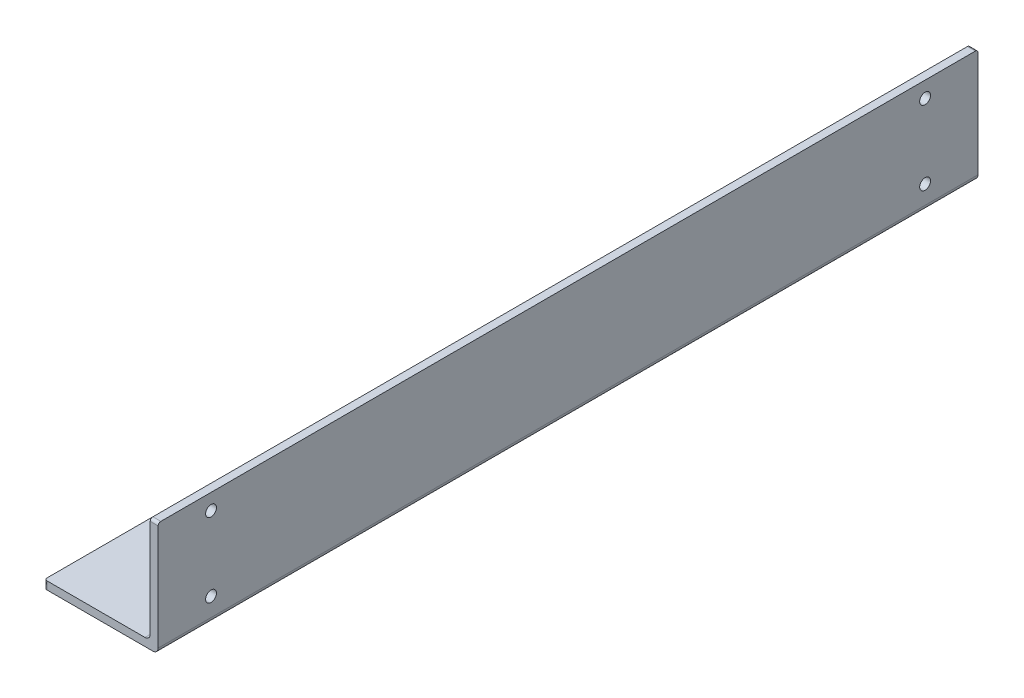
ISO-10303-21;
HEADER;
FILE_DESCRIPTION(('STEP AP214'),'2;1');
FILE_NAME('part.step','',(''),(''),'','','');
FILE_SCHEMA(('AUTOMOTIVE_DESIGN { 1 0 10303 214 1 1 1 1 }'));
ENDSEC;
DATA;
#1=APPLICATION_CONTEXT('core data for automotive mechanical design processes');
#2=APPLICATION_PROTOCOL_DEFINITION('international standard','automotive_design',2000,#1);
#3=PRODUCT_CONTEXT('',#1,'mechanical');
#4=PRODUCT('Part','Part','',(#3));
#5=PRODUCT_RELATED_PRODUCT_CATEGORY('part','',(#4));
#6=PRODUCT_DEFINITION_FORMATION('','',#4);
#7=PRODUCT_DEFINITION_CONTEXT('part definition',#1,'design');
#8=PRODUCT_DEFINITION('design','',#6,#7);
#9=PRODUCT_DEFINITION_SHAPE('','',#8);
#10=(LENGTH_UNIT() NAMED_UNIT(*) SI_UNIT(.MILLI.,.METRE.));
#11=(NAMED_UNIT(*) PLANE_ANGLE_UNIT() SI_UNIT($,.RADIAN.));
#12=(NAMED_UNIT(*) SI_UNIT($,.STERADIAN.) SOLID_ANGLE_UNIT());
#13=UNCERTAINTY_MEASURE_WITH_UNIT(LENGTH_MEASURE(1.E-05),#10,'distance_accuracy_value','');
#14=(GEOMETRIC_REPRESENTATION_CONTEXT(3) GLOBAL_UNCERTAINTY_ASSIGNED_CONTEXT((#13)) GLOBAL_UNIT_ASSIGNED_CONTEXT((#10,
#11,#12)) REPRESENTATION_CONTEXT('',''));
#15=CARTESIAN_POINT('',(0.,0.,0.));
#16=DIRECTION('',(0.,0.,1.));
#17=DIRECTION('',(1.,0.,0.));
#18=AXIS2_PLACEMENT_3D('',#15,#16,#17);
#19=CARTESIAN_POINT('',(3.,0.,0.));
#20=DIRECTION('',(0.,0.,-1.));
#21=DIRECTION('',(-1.,0.,0.));
#22=AXIS2_PLACEMENT_3D('',#19,#20,#21);
#23=PLANE('',#22);
#24=DIRECTION('',(1.,0.,0.));
#25=VECTOR('',#24,1.);
#26=CARTESIAN_POINT('',(0.,3.,0.));
#27=LINE('',#26,#25);
#28=CARTESIAN_POINT('',(-39.,3.,0.));
#29=VERTEX_POINT('',#28);
#30=CARTESIAN_POINT('',(-2.,3.,0.));
#31=VERTEX_POINT('',#30);
#32=EDGE_CURVE('E262',#29,#31,#27,.T.);
#33=ORIENTED_EDGE('',*,*,#32,.F.);
#34=DIRECTION('',(0.,-1.,0.));
#35=VECTOR('',#34,1.);
#36=CARTESIAN_POINT('',(-39.,0.,0.));
#37=LINE('',#36,#35);
#38=CARTESIAN_POINT('',(-39.,0.,0.));
#39=VERTEX_POINT('',#38);
#40=EDGE_CURVE('E190',#29,#39,#37,.T.);
#41=ORIENTED_EDGE('',*,*,#40,.T.);
#42=DIRECTION('',(-1.,0.,0.));
#43=VECTOR('',#42,1.);
#44=CARTESIAN_POINT('',(3.,0.,0.));
#45=LINE('',#44,#43);
#46=CARTESIAN_POINT('',(1.,0.,0.));
#47=VERTEX_POINT('',#46);
#48=EDGE_CURVE('E153',#47,#39,#45,.T.);
#49=ORIENTED_EDGE('',*,*,#48,.F.);
#50=CARTESIAN_POINT('',(1.,2.,0.));
#51=DIRECTION('',(0.,0.,-1.));
#52=DIRECTION('',(-1.,0.,0.));
#53=AXIS2_PLACEMENT_3D('',#50,#51,#52);
#54=CIRCLE('',#53,2.);
#55=CARTESIAN_POINT('',(3.,2.,0.));
#56=VERTEX_POINT('',#55);
#57=EDGE_CURVE('E149',#47,#56,#54,.F.);
#58=ORIENTED_EDGE('',*,*,#57,.T.);
#59=DIRECTION('',(0.,-1.,0.));
#60=VECTOR('',#59,1.);
#61=CARTESIAN_POINT('',(3.,0.,0.));
#62=LINE('',#61,#60);
#63=CARTESIAN_POINT('',(3.,42.,0.));
#64=VERTEX_POINT('',#63);
#65=EDGE_CURVE('E133',#64,#56,#62,.T.);
#66=ORIENTED_EDGE('',*,*,#65,.F.);
#67=DIRECTION('',(-1.,0.,0.));
#68=VECTOR('',#67,1.);
#69=CARTESIAN_POINT('',(3.,42.,0.));
#70=LINE('',#69,#68);
#71=CARTESIAN_POINT('',(0.,42.,0.));
#72=VERTEX_POINT('',#71);
#73=EDGE_CURVE('E187',#64,#72,#70,.T.);
#74=ORIENTED_EDGE('',*,*,#73,.T.);
#75=DIRECTION('',(0.,-1.,0.));
#76=VECTOR('',#75,1.);
#77=CARTESIAN_POINT('',(0.,0.,0.));
#78=LINE('',#77,#76);
#79=CARTESIAN_POINT('',(0.,5.,0.));
#80=VERTEX_POINT('',#79);
#81=EDGE_CURVE('E270',#72,#80,#78,.T.);
#82=ORIENTED_EDGE('',*,*,#81,.T.);
#83=CARTESIAN_POINT('',(-2.,5.,0.));
#84=DIRECTION('',(0.,0.,-1.));
#85=DIRECTION('',(-1.,0.,0.));
#86=AXIS2_PLACEMENT_3D('',#83,#84,#85);
#87=CIRCLE('',#86,2.);
#88=EDGE_CURVE('E183',#80,#31,#87,.T.);
#89=ORIENTED_EDGE('',*,*,#88,.T.);
#90=EDGE_LOOP('',(#33,#41,#49,#58,#66,#74,#82,#89));
#91=FACE_BOUND('',#90,.T.);
#92=ADVANCED_FACE('F42',(#91),#23,.F.);
#93=CARTESIAN_POINT('',(3.,0.,0.));
#94=DIRECTION('',(0.,1.,0.));
#95=DIRECTION('',(0.,0.,1.));
#96=AXIS2_PLACEMENT_3D('',#93,#94,#95);
#97=PLANE('',#96);
#98=ORIENTED_EDGE('',*,*,#48,.T.);
#99=CARTESIAN_POINT('',(-39.,0.,-1.));
#100=DIRECTION('',(0.,1.,0.));
#101=DIRECTION('',(0.,0.,1.));
#102=AXIS2_PLACEMENT_3D('',#99,#100,#101);
#103=CIRCLE('',#102,1.);
#104=CARTESIAN_POINT('',(-40.,0.,-1.));
#105=VERTEX_POINT('',#104);
#106=EDGE_CURVE('E196',#39,#105,#103,.F.);
#107=ORIENTED_EDGE('',*,*,#106,.T.);
#108=DIRECTION('',(0.,0.,1.));
#109=VECTOR('',#108,1.);
#110=CARTESIAN_POINT('',(-40.,0.,-310.));
#111=LINE('',#110,#109);
#112=CARTESIAN_POINT('',(-40.,0.,-309.));
#113=VERTEX_POINT('',#112);
#114=EDGE_CURVE('E247',#113,#105,#111,.T.);
#115=ORIENTED_EDGE('',*,*,#114,.F.);
#116=CARTESIAN_POINT('',(-39.,0.,-309.));
#117=DIRECTION('',(0.,1.,0.));
#118=DIRECTION('',(0.,0.,1.));
#119=AXIS2_PLACEMENT_3D('',#116,#117,#118);
#120=CIRCLE('',#119,1.);
#121=CARTESIAN_POINT('',(-39.,0.,-310.));
#122=VERTEX_POINT('',#121);
#123=EDGE_CURVE('E193',#113,#122,#120,.F.);
#124=ORIENTED_EDGE('',*,*,#123,.T.);
#125=DIRECTION('',(-1.,0.,0.));
#126=VECTOR('',#125,1.);
#127=CARTESIAN_POINT('',(3.,0.,-310.));
#128=LINE('',#127,#126);
#129=CARTESIAN_POINT('',(1.,0.,-310.));
#130=VERTEX_POINT('',#129);
#131=EDGE_CURVE('E167',#130,#122,#128,.T.);
#132=ORIENTED_EDGE('',*,*,#131,.F.);
#133=DIRECTION('',(0.,0.,-1.));
#134=VECTOR('',#133,1.);
#135=CARTESIAN_POINT('',(1.,0.,0.));
#136=LINE('',#135,#134);
#137=EDGE_CURVE('E158',#130,#47,#136,.F.);
#138=ORIENTED_EDGE('',*,*,#137,.T.);
#139=EDGE_LOOP('',(#98,#107,#115,#124,#132,#138));
#140=FACE_BOUND('',#139,.T.);
#141=ADVANCED_FACE('F341',(#140),#97,.F.);
#142=CARTESIAN_POINT('',(3.,43.,-310.));
#143=DIRECTION('',(0.,0.,1.));
#144=DIRECTION('',(1.,0.,0.));
#145=AXIS2_PLACEMENT_3D('',#142,#143,#144);
#146=PLANE('',#145);
#147=ORIENTED_EDGE('',*,*,#131,.T.);
#148=DIRECTION('',(0.,-1.,0.));
#149=VECTOR('',#148,1.);
#150=CARTESIAN_POINT('',(-39.,43.,-310.));
#151=LINE('',#150,#149);
#152=CARTESIAN_POINT('',(-39.,3.,-310.));
#153=VERTEX_POINT('',#152);
#154=EDGE_CURVE('E215',#122,#153,#151,.F.);
#155=ORIENTED_EDGE('',*,*,#154,.T.);
#156=DIRECTION('',(-1.,0.,0.));
#157=VECTOR('',#156,1.);
#158=CARTESIAN_POINT('',(0.,3.,-310.));
#159=LINE('',#158,#157);
#160=CARTESIAN_POINT('',(-2.,3.,-310.));
#161=VERTEX_POINT('',#160);
#162=EDGE_CURVE('E252',#161,#153,#159,.T.);
#163=ORIENTED_EDGE('',*,*,#162,.F.);
#164=CARTESIAN_POINT('',(-2.,5.,-310.));
#165=DIRECTION('',(0.,0.,1.));
#166=DIRECTION('',(1.,0.,0.));
#167=AXIS2_PLACEMENT_3D('',#164,#165,#166);
#168=CIRCLE('',#167,2.);
#169=CARTESIAN_POINT('',(0.,5.,-310.));
#170=VERTEX_POINT('',#169);
#171=EDGE_CURVE('E180',#161,#170,#168,.T.);
#172=ORIENTED_EDGE('',*,*,#171,.T.);
#173=DIRECTION('',(0.,1.,0.));
#174=VECTOR('',#173,1.);
#175=CARTESIAN_POINT('',(0.,43.,-310.));
#176=LINE('',#175,#174);
#177=CARTESIAN_POINT('',(0.,42.,-310.));
#178=VERTEX_POINT('',#177);
#179=EDGE_CURVE('E273',#170,#178,#176,.T.);
#180=ORIENTED_EDGE('',*,*,#179,.T.);
#181=DIRECTION('',(-1.,0.,0.));
#182=VECTOR('',#181,1.);
#183=CARTESIAN_POINT('',(3.,42.,-310.));
#184=LINE('',#183,#182);
#185=CARTESIAN_POINT('',(3.,42.,-310.));
#186=VERTEX_POINT('',#185);
#187=EDGE_CURVE('E212',#178,#186,#184,.F.);
#188=ORIENTED_EDGE('',*,*,#187,.T.);
#189=DIRECTION('',(0.,1.,0.));
#190=VECTOR('',#189,1.);
#191=CARTESIAN_POINT('',(3.,43.,-310.));
#192=LINE('',#191,#190);
#193=CARTESIAN_POINT('',(3.,2.,-310.));
#194=VERTEX_POINT('',#193);
#195=EDGE_CURVE('E144',#194,#186,#192,.T.);
#196=ORIENTED_EDGE('',*,*,#195,.F.);
#197=CARTESIAN_POINT('',(1.,2.,-310.));
#198=DIRECTION('',(0.,0.,1.));
#199=DIRECTION('',(1.,0.,0.));
#200=AXIS2_PLACEMENT_3D('',#197,#198,#199);
#201=CIRCLE('',#200,2.);
#202=EDGE_CURVE('E161',#194,#130,#201,.F.);
#203=ORIENTED_EDGE('',*,*,#202,.T.);
#204=EDGE_LOOP('',(#147,#155,#163,#172,#180,#188,#196,#203));
#205=FACE_BOUND('',#204,.T.);
#206=ADVANCED_FACE('F283',(#205),#146,.F.);
#207=CARTESIAN_POINT('',(3.,43.,0.));
#208=DIRECTION('',(0.,-1.,0.));
#209=DIRECTION('',(0.,0.,-1.));
#210=AXIS2_PLACEMENT_3D('',#207,#208,#209);
#211=PLANE('',#210);
#212=DIRECTION('',(0.,0.,1.));
#213=VECTOR('',#212,1.);
#214=CARTESIAN_POINT('',(3.,43.,0.));
#215=LINE('',#214,#213);
#216=CARTESIAN_POINT('',(3.,43.,-309.));
#217=VERTEX_POINT('',#216);
#218=CARTESIAN_POINT('',(3.,43.,-1.));
#219=VERTEX_POINT('',#218);
#220=EDGE_CURVE('E267',#217,#219,#215,.T.);
#221=ORIENTED_EDGE('',*,*,#220,.F.);
#222=DIRECTION('',(-1.,0.,0.));
#223=VECTOR('',#222,1.);
#224=CARTESIAN_POINT('',(3.,43.,-309.));
#225=LINE('',#224,#223);
#226=CARTESIAN_POINT('',(0.,43.,-309.));
#227=VERTEX_POINT('',#226);
#228=EDGE_CURVE('E220',#217,#227,#225,.T.);
#229=ORIENTED_EDGE('',*,*,#228,.T.);
#230=DIRECTION('',(0.,0.,1.));
#231=VECTOR('',#230,1.);
#232=CARTESIAN_POINT('',(0.,43.,0.));
#233=LINE('',#232,#231);
#234=CARTESIAN_POINT('',(0.,43.,-1.));
#235=VERTEX_POINT('',#234);
#236=EDGE_CURVE('E145',#227,#235,#233,.T.);
#237=ORIENTED_EDGE('',*,*,#236,.T.);
#238=DIRECTION('',(-1.,0.,0.));
#239=VECTOR('',#238,1.);
#240=CARTESIAN_POINT('',(3.,43.,-1.));
#241=LINE('',#240,#239);
#242=EDGE_CURVE('E60',#235,#219,#241,.F.);
#243=ORIENTED_EDGE('',*,*,#242,.T.);
#244=EDGE_LOOP('',(#221,#229,#237,#243));
#245=FACE_BOUND('',#244,.T.);
#246=ADVANCED_FACE('F320',(#245),#211,.F.);
#247=CARTESIAN_POINT('',(3.,0.,0.));
#248=DIRECTION('',(-1.,0.,0.));
#249=DIRECTION('',(0.,0.,1.));
#250=AXIS2_PLACEMENT_3D('',#247,#248,#249);
#251=PLANE('',#250);
#252=CARTESIAN_POINT('',(3.,37.,-290.));
#253=DIRECTION('',(1.,0.,0.));
#254=DIRECTION('',(0.,0.,1.));
#255=AXIS2_PLACEMENT_3D('',#252,#253,#254);
#256=CIRCLE('',#255,2.04999999999997);
#257=CARTESIAN_POINT('',(3.,37.,-287.95));
#258=VERTEX_POINT('',#257);
#259=EDGE_CURVE('E303',#258,#258,#256,.T.);
#260=ORIENTED_EDGE('',*,*,#259,.F.);
#261=EDGE_LOOP('',(#260));
#262=FACE_BOUND('',#261,.T.);
#263=CARTESIAN_POINT('',(3.,8.99999999999998,-290.));
#264=DIRECTION('',(1.,0.,0.));
#265=DIRECTION('',(0.,0.,1.));
#266=AXIS2_PLACEMENT_3D('',#263,#264,#265);
#267=CIRCLE('',#266,2.05000000000007);
#268=CARTESIAN_POINT('',(3.,8.99999999999998,-287.95));
#269=VERTEX_POINT('',#268);
#270=EDGE_CURVE('E307',#269,#269,#267,.T.);
#271=ORIENTED_EDGE('',*,*,#270,.F.);
#272=EDGE_LOOP('',(#271));
#273=FACE_BOUND('',#272,.T.);
#274=CARTESIAN_POINT('',(3.,8.99999999999998,-20.));
#275=DIRECTION('',(1.,0.,0.));
#276=DIRECTION('',(0.,0.,-1.));
#277=AXIS2_PLACEMENT_3D('',#274,#275,#276);
#278=CIRCLE('',#277,2.05);
#279=CARTESIAN_POINT('',(3.,8.99999999999998,-22.05));
#280=VERTEX_POINT('',#279);
#281=EDGE_CURVE('E302',#280,#280,#278,.T.);
#282=ORIENTED_EDGE('',*,*,#281,.F.);
#283=EDGE_LOOP('',(#282));
#284=FACE_BOUND('',#283,.T.);
#285=CARTESIAN_POINT('',(3.,37.,-20.));
#286=DIRECTION('',(1.,0.,0.));
#287=DIRECTION('',(0.,0.,-1.));
#288=AXIS2_PLACEMENT_3D('',#285,#286,#287);
#289=CIRCLE('',#288,2.05);
#290=CARTESIAN_POINT('',(3.,37.,-22.05));
#291=VERTEX_POINT('',#290);
#292=EDGE_CURVE('E237',#291,#291,#289,.T.);
#293=ORIENTED_EDGE('',*,*,#292,.F.);
#294=EDGE_LOOP('',(#293));
#295=FACE_BOUND('',#294,.T.);
#296=ORIENTED_EDGE('',*,*,#195,.T.);
#297=CARTESIAN_POINT('',(3.,42.,-309.));
#298=DIRECTION('',(-1.,0.,0.));
#299=DIRECTION('',(0.,0.,1.));
#300=AXIS2_PLACEMENT_3D('',#297,#298,#299);
#301=CIRCLE('',#300,1.);
#302=EDGE_CURVE('E11',#186,#217,#301,.F.);
#303=ORIENTED_EDGE('',*,*,#302,.T.);
#304=ORIENTED_EDGE('',*,*,#220,.T.);
#305=CARTESIAN_POINT('',(3.,42.,-1.));
#306=DIRECTION('',(-1.,0.,0.));
#307=DIRECTION('',(0.,0.,1.));
#308=AXIS2_PLACEMENT_3D('',#305,#306,#307);
#309=CIRCLE('',#308,1.);
#310=EDGE_CURVE('E52',#219,#64,#309,.F.);
#311=ORIENTED_EDGE('',*,*,#310,.T.);
#312=ORIENTED_EDGE('',*,*,#65,.T.);
#313=DIRECTION('',(0.,0.,-1.));
#314=VECTOR('',#313,1.);
#315=CARTESIAN_POINT('',(3.,2.,0.));
#316=LINE('',#315,#314);
#317=EDGE_CURVE('E137',#56,#194,#316,.T.);
#318=ORIENTED_EDGE('',*,*,#317,.T.);
#319=EDGE_LOOP('',(#296,#303,#304,#311,#312,#318));
#320=FACE_BOUND('',#319,.T.);
#321=ADVANCED_FACE('F135',(#262,#273,#284,#295,#320),#251,.F.);
#322=CARTESIAN_POINT('',(0.,0.,0.));
#323=DIRECTION('',(-1.,0.,0.));
#324=DIRECTION('',(0.,0.,1.));
#325=AXIS2_PLACEMENT_3D('',#322,#323,#324);
#326=PLANE('',#325);
#327=CARTESIAN_POINT('',(0.,37.,-290.));
#328=DIRECTION('',(-1.,0.,0.));
#329=DIRECTION('',(0.,0.,1.));
#330=AXIS2_PLACEMENT_3D('',#327,#328,#329);
#331=CIRCLE('',#330,2.04999999999997);
#332=CARTESIAN_POINT('',(0.,37.,-287.95));
#333=VERTEX_POINT('',#332);
#334=EDGE_CURVE('E46',#333,#333,#331,.T.);
#335=ORIENTED_EDGE('',*,*,#334,.F.);
#336=EDGE_LOOP('',(#335));
#337=FACE_BOUND('',#336,.T.);
#338=CARTESIAN_POINT('',(0.,8.99999999999998,-290.));
#339=DIRECTION('',(-1.,0.,0.));
#340=DIRECTION('',(0.,0.,1.));
#341=AXIS2_PLACEMENT_3D('',#338,#339,#340);
#342=CIRCLE('',#341,2.05000000000007);
#343=CARTESIAN_POINT('',(0.,8.99999999999998,-287.95));
#344=VERTEX_POINT('',#343);
#345=EDGE_CURVE('E240',#344,#344,#342,.T.);
#346=ORIENTED_EDGE('',*,*,#345,.F.);
#347=EDGE_LOOP('',(#346));
#348=FACE_BOUND('',#347,.T.);
#349=CARTESIAN_POINT('',(0.,8.99999999999998,-20.));
#350=DIRECTION('',(-1.,0.,0.));
#351=DIRECTION('',(0.,0.,1.));
#352=AXIS2_PLACEMENT_3D('',#349,#350,#351);
#353=CIRCLE('',#352,2.05);
#354=CARTESIAN_POINT('',(0.,8.99999999999998,-17.95));
#355=VERTEX_POINT('',#354);
#356=EDGE_CURVE('E236',#355,#355,#353,.T.);
#357=ORIENTED_EDGE('',*,*,#356,.F.);
#358=EDGE_LOOP('',(#357));
#359=FACE_BOUND('',#358,.T.);
#360=CARTESIAN_POINT('',(0.,37.,-20.));
#361=DIRECTION('',(-1.,0.,0.));
#362=DIRECTION('',(0.,0.,1.));
#363=AXIS2_PLACEMENT_3D('',#360,#361,#362);
#364=CIRCLE('',#363,2.05);
#365=CARTESIAN_POINT('',(0.,37.,-17.95));
#366=VERTEX_POINT('',#365);
#367=EDGE_CURVE('E232',#366,#366,#364,.T.);
#368=ORIENTED_EDGE('',*,*,#367,.F.);
#369=EDGE_LOOP('',(#368));
#370=FACE_BOUND('',#369,.T.);
#371=ORIENTED_EDGE('',*,*,#236,.F.);
#372=CARTESIAN_POINT('',(0.,42.,-309.));
#373=DIRECTION('',(-1.,0.,0.));
#374=DIRECTION('',(0.,0.,1.));
#375=AXIS2_PLACEMENT_3D('',#372,#373,#374);
#376=CIRCLE('',#375,1.);
#377=EDGE_CURVE('E227',#227,#178,#376,.T.);
#378=ORIENTED_EDGE('',*,*,#377,.T.);
#379=ORIENTED_EDGE('',*,*,#179,.F.);
#380=DIRECTION('',(0.,0.,-1.));
#381=VECTOR('',#380,1.);
#382=CARTESIAN_POINT('',(0.,5.,0.));
#383=LINE('',#382,#381);
#384=EDGE_CURVE('E176',#170,#80,#383,.F.);
#385=ORIENTED_EDGE('',*,*,#384,.T.);
#386=ORIENTED_EDGE('',*,*,#81,.F.);
#387=CARTESIAN_POINT('',(0.,42.,-1.));
#388=DIRECTION('',(-1.,0.,0.));
#389=DIRECTION('',(0.,0.,1.));
#390=AXIS2_PLACEMENT_3D('',#387,#388,#389);
#391=CIRCLE('',#390,1.);
#392=EDGE_CURVE('E224',#72,#235,#391,.T.);
#393=ORIENTED_EDGE('',*,*,#392,.T.);
#394=EDGE_LOOP('',(#371,#378,#379,#385,#386,#393));
#395=FACE_BOUND('',#394,.T.);
#396=ADVANCED_FACE('F319',(#337,#348,#359,#370,#395),#326,.T.);
#397=CARTESIAN_POINT('',(-40.,3.,-310.));
#398=DIRECTION('',(1.,0.,0.));
#399=DIRECTION('',(0.,0.,-1.));
#400=AXIS2_PLACEMENT_3D('',#397,#398,#399);
#401=PLANE('',#400);
#402=ORIENTED_EDGE('',*,*,#114,.T.);
#403=DIRECTION('',(0.,-1.,0.));
#404=VECTOR('',#403,1.);
#405=CARTESIAN_POINT('',(-40.,3.,-1.));
#406=LINE('',#405,#404);
#407=CARTESIAN_POINT('',(-40.,3.,-1.));
#408=VERTEX_POINT('',#407);
#409=EDGE_CURVE('E203',#105,#408,#406,.F.);
#410=ORIENTED_EDGE('',*,*,#409,.T.);
#411=DIRECTION('',(0.,0.,1.));
#412=VECTOR('',#411,1.);
#413=CARTESIAN_POINT('',(-40.,3.,-310.));
#414=LINE('',#413,#412);
#415=CARTESIAN_POINT('',(-40.,3.,-309.));
#416=VERTEX_POINT('',#415);
#417=EDGE_CURVE('E259',#416,#408,#414,.T.);
#418=ORIENTED_EDGE('',*,*,#417,.F.);
#419=DIRECTION('',(0.,-1.,0.));
#420=VECTOR('',#419,1.);
#421=CARTESIAN_POINT('',(-40.,3.,-309.));
#422=LINE('',#421,#420);
#423=EDGE_CURVE('E199',#416,#113,#422,.T.);
#424=ORIENTED_EDGE('',*,*,#423,.T.);
#425=EDGE_LOOP('',(#402,#410,#418,#424));
#426=FACE_BOUND('',#425,.T.);
#427=ADVANCED_FACE('F295',(#426),#401,.F.);
#428=CARTESIAN_POINT('',(0.,3.,0.));
#429=DIRECTION('',(0.,1.,0.));
#430=DIRECTION('',(0.,0.,1.));
#431=AXIS2_PLACEMENT_3D('',#428,#429,#430);
#432=PLANE('',#431);
#433=ORIENTED_EDGE('',*,*,#417,.T.);
#434=CARTESIAN_POINT('',(-39.,3.,-1.));
#435=DIRECTION('',(0.,1.,0.));
#436=DIRECTION('',(0.,0.,1.));
#437=AXIS2_PLACEMENT_3D('',#434,#435,#436);
#438=CIRCLE('',#437,1.);
#439=EDGE_CURVE('E209',#408,#29,#438,.T.);
#440=ORIENTED_EDGE('',*,*,#439,.T.);
#441=ORIENTED_EDGE('',*,*,#32,.T.);
#442=DIRECTION('',(0.,0.,-1.));
#443=VECTOR('',#442,1.);
#444=CARTESIAN_POINT('',(-2.,3.,-310.));
#445=LINE('',#444,#443);
#446=EDGE_CURVE('E157',#31,#161,#445,.T.);
#447=ORIENTED_EDGE('',*,*,#446,.T.);
#448=ORIENTED_EDGE('',*,*,#162,.T.);
#449=CARTESIAN_POINT('',(-39.,3.,-309.));
#450=DIRECTION('',(0.,1.,0.));
#451=DIRECTION('',(0.,0.,1.));
#452=AXIS2_PLACEMENT_3D('',#449,#450,#451);
#453=CIRCLE('',#452,1.);
#454=EDGE_CURVE('E206',#153,#416,#453,.T.);
#455=ORIENTED_EDGE('',*,*,#454,.T.);
#456=EDGE_LOOP('',(#433,#440,#441,#447,#448,#455));
#457=FACE_BOUND('',#456,.T.);
#458=ADVANCED_FACE('F293',(#457),#432,.T.);
#459=CARTESIAN_POINT('',(1.,2.,0.));
#460=DIRECTION('',(0.,0.,-1.));
#461=DIRECTION('',(-1.,0.,0.));
#462=AXIS2_PLACEMENT_3D('',#459,#460,#461);
#463=CYLINDRICAL_SURFACE('',#462,2.);
#464=ORIENTED_EDGE('',*,*,#57,.F.);
#465=ORIENTED_EDGE('',*,*,#137,.F.);
#466=ORIENTED_EDGE('',*,*,#202,.F.);
#467=ORIENTED_EDGE('',*,*,#317,.F.);
#468=EDGE_LOOP('',(#464,#465,#466,#467));
#469=FACE_BOUND('',#468,.T.);
#470=ADVANCED_FACE('F160',(#469),#463,.T.);
#471=CARTESIAN_POINT('',(-2.,5.,0.));
#472=DIRECTION('',(0.,0.,1.));
#473=DIRECTION('',(1.,0.,0.));
#474=AXIS2_PLACEMENT_3D('',#471,#472,#473);
#475=CYLINDRICAL_SURFACE('',#474,2.);
#476=ORIENTED_EDGE('',*,*,#88,.F.);
#477=ORIENTED_EDGE('',*,*,#384,.F.);
#478=ORIENTED_EDGE('',*,*,#171,.F.);
#479=ORIENTED_EDGE('',*,*,#446,.F.);
#480=EDGE_LOOP('',(#476,#477,#478,#479));
#481=FACE_BOUND('',#480,.T.);
#482=ADVANCED_FACE('F352',(#481),#475,.F.);
#483=CARTESIAN_POINT('',(-39.,0.,-1.));
#484=DIRECTION('',(0.,-1.,0.));
#485=DIRECTION('',(0.,0.,-1.));
#486=AXIS2_PLACEMENT_3D('',#483,#484,#485);
#487=CYLINDRICAL_SURFACE('',#486,1.);
#488=ORIENTED_EDGE('',*,*,#439,.F.);
#489=ORIENTED_EDGE('',*,*,#409,.F.);
#490=ORIENTED_EDGE('',*,*,#106,.F.);
#491=ORIENTED_EDGE('',*,*,#40,.F.);
#492=EDGE_LOOP('',(#488,#489,#490,#491));
#493=FACE_BOUND('',#492,.T.);
#494=ADVANCED_FACE('F355',(#493),#487,.T.);
#495=CARTESIAN_POINT('',(-39.,3.,-309.));
#496=DIRECTION('',(0.,-1.,0.));
#497=DIRECTION('',(0.,0.,-1.));
#498=AXIS2_PLACEMENT_3D('',#495,#496,#497);
#499=CYLINDRICAL_SURFACE('',#498,1.);
#500=ORIENTED_EDGE('',*,*,#454,.F.);
#501=ORIENTED_EDGE('',*,*,#154,.F.);
#502=ORIENTED_EDGE('',*,*,#123,.F.);
#503=ORIENTED_EDGE('',*,*,#423,.F.);
#504=EDGE_LOOP('',(#500,#501,#502,#503));
#505=FACE_BOUND('',#504,.T.);
#506=ADVANCED_FACE('F288',(#505),#499,.T.);
#507=CARTESIAN_POINT('',(3.,42.,-309.));
#508=DIRECTION('',(-1.,0.,0.));
#509=DIRECTION('',(0.,0.,1.));
#510=AXIS2_PLACEMENT_3D('',#507,#508,#509);
#511=CYLINDRICAL_SURFACE('',#510,1.);
#512=ORIENTED_EDGE('',*,*,#302,.F.);
#513=ORIENTED_EDGE('',*,*,#187,.F.);
#514=ORIENTED_EDGE('',*,*,#377,.F.);
#515=ORIENTED_EDGE('',*,*,#228,.F.);
#516=EDGE_LOOP('',(#512,#513,#514,#515));
#517=FACE_BOUND('',#516,.T.);
#518=ADVANCED_FACE('F336',(#517),#511,.T.);
#519=CARTESIAN_POINT('',(3.,42.,-1.));
#520=DIRECTION('',(-1.,0.,0.));
#521=DIRECTION('',(0.,0.,1.));
#522=AXIS2_PLACEMENT_3D('',#519,#520,#521);
#523=CYLINDRICAL_SURFACE('',#522,1.);
#524=ORIENTED_EDGE('',*,*,#310,.F.);
#525=ORIENTED_EDGE('',*,*,#242,.F.);
#526=ORIENTED_EDGE('',*,*,#392,.F.);
#527=ORIENTED_EDGE('',*,*,#73,.F.);
#528=EDGE_LOOP('',(#524,#525,#526,#527));
#529=FACE_BOUND('',#528,.T.);
#530=ADVANCED_FACE('F44',(#529),#523,.T.);
#531=CARTESIAN_POINT('',(-40.,37.,-20.));
#532=DIRECTION('',(1.,0.,0.));
#533=DIRECTION('',(0.,0.,-1.));
#534=AXIS2_PLACEMENT_3D('',#531,#532,#533);
#535=CYLINDRICAL_SURFACE('',#534,2.05);
#536=ORIENTED_EDGE('',*,*,#367,.T.);
#537=EDGE_LOOP('',(#536));
#538=FACE_BOUND('',#537,.T.);
#539=ORIENTED_EDGE('',*,*,#292,.T.);
#540=EDGE_LOOP('',(#539));
#541=FACE_BOUND('',#540,.T.);
#542=ADVANCED_FACE('F325',(#538,#541),#535,.F.);
#543=CARTESIAN_POINT('',(-40.,8.99999999999998,-20.));
#544=DIRECTION('',(1.,0.,0.));
#545=DIRECTION('',(0.,0.,-1.));
#546=AXIS2_PLACEMENT_3D('',#543,#544,#545);
#547=CYLINDRICAL_SURFACE('',#546,2.05);
#548=ORIENTED_EDGE('',*,*,#356,.T.);
#549=EDGE_LOOP('',(#548));
#550=FACE_BOUND('',#549,.T.);
#551=ORIENTED_EDGE('',*,*,#281,.T.);
#552=EDGE_LOOP('',(#551));
#553=FACE_BOUND('',#552,.T.);
#554=ADVANCED_FACE('F315',(#550,#553),#547,.F.);
#555=CARTESIAN_POINT('',(-40.,8.99999999999998,-290.));
#556=DIRECTION('',(1.,0.,0.));
#557=DIRECTION('',(0.,0.,-1.));
#558=AXIS2_PLACEMENT_3D('',#555,#556,#557);
#559=CYLINDRICAL_SURFACE('',#558,2.05000000000007);
#560=ORIENTED_EDGE('',*,*,#345,.T.);
#561=EDGE_LOOP('',(#560));
#562=FACE_BOUND('',#561,.T.);
#563=ORIENTED_EDGE('',*,*,#270,.T.);
#564=EDGE_LOOP('',(#563));
#565=FACE_BOUND('',#564,.T.);
#566=ADVANCED_FACE('F333',(#562,#565),#559,.F.);
#567=CARTESIAN_POINT('',(-40.,37.,-290.));
#568=DIRECTION('',(1.,0.,0.));
#569=DIRECTION('',(0.,0.,-1.));
#570=AXIS2_PLACEMENT_3D('',#567,#568,#569);
#571=CYLINDRICAL_SURFACE('',#570,2.04999999999997);
#572=ORIENTED_EDGE('',*,*,#334,.T.);
#573=EDGE_LOOP('',(#572));
#574=FACE_BOUND('',#573,.T.);
#575=ORIENTED_EDGE('',*,*,#259,.T.);
#576=EDGE_LOOP('',(#575));
#577=FACE_BOUND('',#576,.T.);
#578=ADVANCED_FACE('F509',(#574,#577),#571,.F.);
#579=CLOSED_SHELL('',(#92,#141,#206,#246,#321,#396,#427,#458,#470,#482,#494,#506,#518,#530,#542,
#554,#566,#578));
#580=MANIFOLD_SOLID_BREP('B2',#579);
#581=ADVANCED_BREP_SHAPE_REPRESENTATION('',(#18,#580),#14);
#582=SHAPE_DEFINITION_REPRESENTATION(#9,#581);
ENDSEC;
END-ISO-10303-21;
